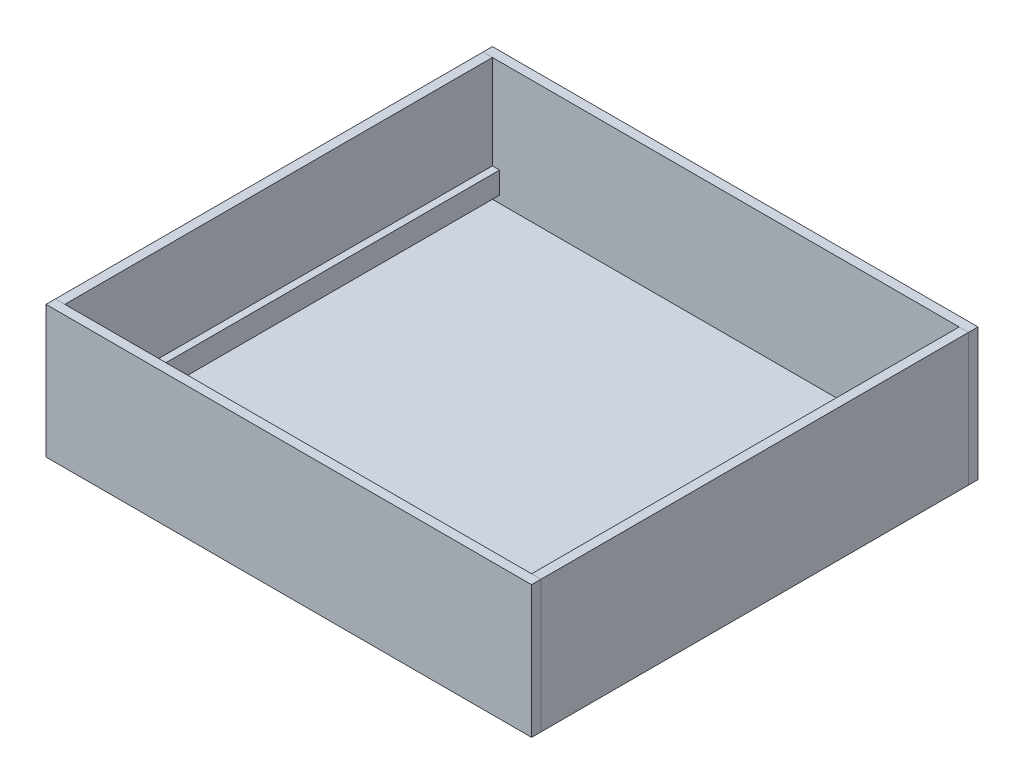
ISO-10303-21;
HEADER;
FILE_DESCRIPTION(('STEP AP214'),'2;1');
FILE_NAME('part.step','',(''),(''),'','','');
FILE_SCHEMA(('AUTOMOTIVE_DESIGN { 1 0 10303 214 1 1 1 1 }'));
ENDSEC;
DATA;
#1=APPLICATION_CONTEXT('core data for automotive mechanical design processes');
#2=APPLICATION_PROTOCOL_DEFINITION('international standard','automotive_design',2000,#1);
#3=PRODUCT_CONTEXT('',#1,'mechanical');
#4=PRODUCT('Part','Part','',(#3));
#5=PRODUCT_RELATED_PRODUCT_CATEGORY('part','',(#4));
#6=PRODUCT_DEFINITION_FORMATION('','',#4);
#7=PRODUCT_DEFINITION_CONTEXT('part definition',#1,'design');
#8=PRODUCT_DEFINITION('design','',#6,#7);
#9=PRODUCT_DEFINITION_SHAPE('','',#8);
#10=(LENGTH_UNIT() NAMED_UNIT(*) SI_UNIT(.MILLI.,.METRE.));
#11=(NAMED_UNIT(*) PLANE_ANGLE_UNIT() SI_UNIT($,.RADIAN.));
#12=(NAMED_UNIT(*) SI_UNIT($,.STERADIAN.) SOLID_ANGLE_UNIT());
#13=UNCERTAINTY_MEASURE_WITH_UNIT(LENGTH_MEASURE(1.E-05),#10,'distance_accuracy_value','');
#14=(GEOMETRIC_REPRESENTATION_CONTEXT(3) GLOBAL_UNCERTAINTY_ASSIGNED_CONTEXT((#13)) GLOBAL_UNIT_ASSIGNED_CONTEXT((#10,
#11,#12)) REPRESENTATION_CONTEXT('',''));
#15=CARTESIAN_POINT('',(0.,0.,0.));
#16=DIRECTION('',(0.,0.,1.));
#17=DIRECTION('',(1.,0.,0.));
#18=AXIS2_PLACEMENT_3D('',#15,#16,#17);
#19=CARTESIAN_POINT('',(-425.45,231.775,16.51));
#20=DIRECTION('',(1.,0.,0.));
#21=DIRECTION('',(0.,0.,-1.));
#22=AXIS2_PLACEMENT_3D('',#19,#20,#21);
#23=PLANE('',#22);
#24=DIRECTION('',(0.,-1.,0.));
#25=VECTOR('',#24,1.);
#26=CARTESIAN_POINT('',(-425.45,231.775,0.));
#27=LINE('',#26,#25);
#28=CARTESIAN_POINT('',(-425.45,231.775,0.));
#29=VERTEX_POINT('',#28);
#30=CARTESIAN_POINT('',(-425.45,0.,0.));
#31=VERTEX_POINT('',#30);
#32=EDGE_CURVE('E119',#29,#31,#27,.T.);
#33=ORIENTED_EDGE('',*,*,#32,.T.);
#34=DIRECTION('',(0.,0.,-1.));
#35=VECTOR('',#34,1.);
#36=CARTESIAN_POINT('',(-425.45,0.,16.51));
#37=LINE('',#36,#35);
#38=CARTESIAN_POINT('',(-425.45,0.,16.51));
#39=VERTEX_POINT('',#38);
#40=EDGE_CURVE('E12',#39,#31,#37,.T.);
#41=ORIENTED_EDGE('',*,*,#40,.F.);
#42=DIRECTION('',(0.,-1.,0.));
#43=VECTOR('',#42,1.);
#44=CARTESIAN_POINT('',(-425.45,231.775,16.51));
#45=LINE('',#44,#43);
#46=CARTESIAN_POINT('',(-425.45,231.775,16.51));
#47=VERTEX_POINT('',#46);
#48=EDGE_CURVE('E107',#47,#39,#45,.T.);
#49=ORIENTED_EDGE('',*,*,#48,.F.);
#50=DIRECTION('',(0.,0.,-1.));
#51=VECTOR('',#50,1.);
#52=CARTESIAN_POINT('',(-425.45,231.775,16.51));
#53=LINE('',#52,#51);
#54=EDGE_CURVE('E115',#47,#29,#53,.T.);
#55=ORIENTED_EDGE('',*,*,#54,.T.);
#56=EDGE_LOOP('',(#33,#41,#49,#55));
#57=FACE_BOUND('',#56,.T.);
#58=ADVANCED_FACE('F56',(#57),#23,.F.);
#59=CARTESIAN_POINT('',(-425.45,0.,16.51));
#60=DIRECTION('',(0.,1.,0.));
#61=DIRECTION('',(0.,0.,1.));
#62=AXIS2_PLACEMENT_3D('',#59,#60,#61);
#63=PLANE('',#62);
#64=DIRECTION('',(1.,0.,0.));
#65=VECTOR('',#64,1.);
#66=CARTESIAN_POINT('',(-425.45,0.,0.));
#67=LINE('',#66,#65);
#68=CARTESIAN_POINT('',(425.45,0.,0.));
#69=VERTEX_POINT('',#68);
#70=EDGE_CURVE('E111',#31,#69,#67,.T.);
#71=ORIENTED_EDGE('',*,*,#70,.T.);
#72=DIRECTION('',(0.,0.,-1.));
#73=VECTOR('',#72,1.);
#74=CARTESIAN_POINT('',(425.45,0.,16.51));
#75=LINE('',#74,#73);
#76=CARTESIAN_POINT('',(425.45,0.,16.51));
#77=VERTEX_POINT('',#76);
#78=EDGE_CURVE('E64',#77,#69,#75,.T.);
#79=ORIENTED_EDGE('',*,*,#78,.F.);
#80=DIRECTION('',(1.,0.,0.));
#81=VECTOR('',#80,1.);
#82=CARTESIAN_POINT('',(-425.45,0.,16.51));
#83=LINE('',#82,#81);
#84=EDGE_CURVE('E102',#39,#77,#83,.T.);
#85=ORIENTED_EDGE('',*,*,#84,.F.);
#86=ORIENTED_EDGE('',*,*,#40,.T.);
#87=EDGE_LOOP('',(#71,#79,#85,#86));
#88=FACE_BOUND('',#87,.T.);
#89=ADVANCED_FACE('F110',(#88),#63,.F.);
#90=CARTESIAN_POINT('',(425.45,231.775,16.51));
#91=DIRECTION('',(-1.,0.,0.));
#92=DIRECTION('',(0.,0.,1.));
#93=AXIS2_PLACEMENT_3D('',#90,#91,#92);
#94=PLANE('',#93);
#95=DIRECTION('',(0.,1.,0.));
#96=VECTOR('',#95,1.);
#97=CARTESIAN_POINT('',(425.45,231.775,0.));
#98=LINE('',#97,#96);
#99=CARTESIAN_POINT('',(425.45,231.775,0.));
#100=VERTEX_POINT('',#99);
#101=EDGE_CURVE('E89',#69,#100,#98,.T.);
#102=ORIENTED_EDGE('',*,*,#101,.T.);
#103=DIRECTION('',(0.,0.,-1.));
#104=VECTOR('',#103,1.);
#105=CARTESIAN_POINT('',(425.45,231.775,16.51));
#106=LINE('',#105,#104);
#107=CARTESIAN_POINT('',(425.45,231.775,16.51));
#108=VERTEX_POINT('',#107);
#109=EDGE_CURVE('E112',#108,#100,#106,.T.);
#110=ORIENTED_EDGE('',*,*,#109,.F.);
#111=DIRECTION('',(0.,1.,0.));
#112=VECTOR('',#111,1.);
#113=CARTESIAN_POINT('',(425.45,231.775,16.51));
#114=LINE('',#113,#112);
#115=EDGE_CURVE('E105',#77,#108,#114,.T.);
#116=ORIENTED_EDGE('',*,*,#115,.F.);
#117=ORIENTED_EDGE('',*,*,#78,.T.);
#118=EDGE_LOOP('',(#102,#110,#116,#117));
#119=FACE_BOUND('',#118,.T.);
#120=ADVANCED_FACE('F113',(#119),#94,.F.);
#121=CARTESIAN_POINT('',(-425.45,231.775,16.51));
#122=DIRECTION('',(0.,-1.,0.));
#123=DIRECTION('',(0.,0.,-1.));
#124=AXIS2_PLACEMENT_3D('',#121,#122,#123);
#125=PLANE('',#124);
#126=DIRECTION('',(-1.,0.,0.));
#127=VECTOR('',#126,1.);
#128=CARTESIAN_POINT('',(-425.45,231.775,0.));
#129=LINE('',#128,#127);
#130=EDGE_CURVE('E95',#100,#29,#129,.T.);
#131=ORIENTED_EDGE('',*,*,#130,.T.);
#132=ORIENTED_EDGE('',*,*,#54,.F.);
#133=DIRECTION('',(-1.,0.,0.));
#134=VECTOR('',#133,1.);
#135=CARTESIAN_POINT('',(-425.45,231.775,16.51));
#136=LINE('',#135,#134);
#137=EDGE_CURVE('E72',#108,#47,#136,.T.);
#138=ORIENTED_EDGE('',*,*,#137,.F.);
#139=ORIENTED_EDGE('',*,*,#109,.T.);
#140=EDGE_LOOP('',(#131,#132,#138,#139));
#141=FACE_BOUND('',#140,.T.);
#142=ADVANCED_FACE('F126',(#141),#125,.F.);
#143=CARTESIAN_POINT('',(0.,0.,16.51));
#144=DIRECTION('',(0.,0.,1.));
#145=DIRECTION('',(1.,0.,0.));
#146=AXIS2_PLACEMENT_3D('',#143,#144,#145);
#147=PLANE('',#146);
#148=ORIENTED_EDGE('',*,*,#48,.T.);
#149=ORIENTED_EDGE('',*,*,#84,.T.);
#150=ORIENTED_EDGE('',*,*,#115,.T.);
#151=ORIENTED_EDGE('',*,*,#137,.T.);
#152=EDGE_LOOP('',(#148,#149,#150,#151));
#153=FACE_BOUND('',#152,.T.);
#154=ADVANCED_FACE('F103',(#153),#147,.T.);
#155=CARTESIAN_POINT('',(0.,0.,0.));
#156=DIRECTION('',(0.,0.,1.));
#157=DIRECTION('',(1.,0.,0.));
#158=AXIS2_PLACEMENT_3D('',#155,#156,#157);
#159=PLANE('',#158);
#160=ORIENTED_EDGE('',*,*,#32,.F.);
#161=ORIENTED_EDGE('',*,*,#130,.F.);
#162=ORIENTED_EDGE('',*,*,#101,.F.);
#163=ORIENTED_EDGE('',*,*,#70,.F.);
#164=EDGE_LOOP('',(#160,#161,#162,#163));
#165=FACE_BOUND('',#164,.T.);
#166=ADVANCED_FACE('F129',(#165),#159,.F.);
#167=CLOSED_SHELL('',(#58,#89,#120,#142,#154,#166));
#168=MANIFOLD_SOLID_BREP('B2',#167);
#169=CARTESIAN_POINT('',(0.,0.,-749.3));
#170=DIRECTION('',(0.,0.,-1.));
#171=DIRECTION('',(1.,0.,0.));
#172=AXIS2_PLACEMENT_3D('',#169,#170,#171);
#173=PLANE('',#172);
#174=DIRECTION('',(0.,-1.,0.));
#175=VECTOR('',#174,1.);
#176=CARTESIAN_POINT('',(408.94,29.21,-749.3));
#177=LINE('',#176,#175);
#178=CARTESIAN_POINT('',(408.94,67.31,-749.3));
#179=VERTEX_POINT('',#178);
#180=CARTESIAN_POINT('',(408.94,29.21,-749.3));
#181=VERTEX_POINT('',#180);
#182=EDGE_CURVE('E198',#179,#181,#177,.T.);
#183=ORIENTED_EDGE('',*,*,#182,.T.);
#184=DIRECTION('',(-1.,0.,0.));
#185=VECTOR('',#184,1.);
#186=CARTESIAN_POINT('',(408.94,29.21,-749.3));
#187=LINE('',#186,#185);
#188=CARTESIAN_POINT('',(396.24,29.21,-749.3));
#189=VERTEX_POINT('',#188);
#190=EDGE_CURVE('E237',#181,#189,#187,.T.);
#191=ORIENTED_EDGE('',*,*,#190,.T.);
#192=DIRECTION('',(0.,1.,0.));
#193=VECTOR('',#192,1.);
#194=CARTESIAN_POINT('',(396.24,29.21,-749.3));
#195=LINE('',#194,#193);
#196=CARTESIAN_POINT('',(396.24,67.31,-749.3));
#197=VERTEX_POINT('',#196);
#198=EDGE_CURVE('E235',#189,#197,#195,.T.);
#199=ORIENTED_EDGE('',*,*,#198,.T.);
#200=DIRECTION('',(1.,0.,0.));
#201=VECTOR('',#200,1.);
#202=CARTESIAN_POINT('',(408.94,67.31,-749.3));
#203=LINE('',#202,#201);
#204=EDGE_CURVE('E255',#197,#179,#203,.T.);
#205=ORIENTED_EDGE('',*,*,#204,.T.);
#206=EDGE_LOOP('',(#183,#191,#199,#205));
#207=FACE_BOUND('',#206,.T.);
#208=ADVANCED_FACE('F190',(#207),#173,.T.);
#209=CARTESIAN_POINT('',(0.,0.,0.));
#210=DIRECTION('',(0.,0.,-1.));
#211=DIRECTION('',(1.,0.,0.));
#212=AXIS2_PLACEMENT_3D('',#209,#210,#211);
#213=PLANE('',#212);
#214=DIRECTION('',(0.,-1.,0.));
#215=VECTOR('',#214,1.);
#216=CARTESIAN_POINT('',(408.94,29.21,0.));
#217=LINE('',#216,#215);
#218=CARTESIAN_POINT('',(408.94,67.31,0.));
#219=VERTEX_POINT('',#218);
#220=CARTESIAN_POINT('',(408.94,29.21,0.));
#221=VERTEX_POINT('',#220);
#222=EDGE_CURVE('E243',#219,#221,#217,.T.);
#223=ORIENTED_EDGE('',*,*,#222,.F.);
#224=DIRECTION('',(1.,0.,0.));
#225=VECTOR('',#224,1.);
#226=CARTESIAN_POINT('',(408.94,67.31,0.));
#227=LINE('',#226,#225);
#228=CARTESIAN_POINT('',(396.24,67.31,0.));
#229=VERTEX_POINT('',#228);
#230=EDGE_CURVE('E246',#229,#219,#227,.T.);
#231=ORIENTED_EDGE('',*,*,#230,.F.);
#232=DIRECTION('',(0.,1.,0.));
#233=VECTOR('',#232,1.);
#234=CARTESIAN_POINT('',(396.24,29.21,0.));
#235=LINE('',#234,#233);
#236=CARTESIAN_POINT('',(396.24,29.21,0.));
#237=VERTEX_POINT('',#236);
#238=EDGE_CURVE('E232',#237,#229,#235,.T.);
#239=ORIENTED_EDGE('',*,*,#238,.F.);
#240=DIRECTION('',(-1.,0.,0.));
#241=VECTOR('',#240,1.);
#242=CARTESIAN_POINT('',(408.94,29.21,0.));
#243=LINE('',#242,#241);
#244=EDGE_CURVE('E238',#221,#237,#243,.T.);
#245=ORIENTED_EDGE('',*,*,#244,.F.);
#246=EDGE_LOOP('',(#223,#231,#239,#245));
#247=FACE_BOUND('',#246,.T.);
#248=ADVANCED_FACE('F245',(#247),#213,.F.);
#249=CARTESIAN_POINT('',(408.94,29.21,-789.460926284138));
#250=DIRECTION('',(0.,-1.,0.));
#251=DIRECTION('',(-1.,0.,0.));
#252=AXIS2_PLACEMENT_3D('',#249,#250,#251);
#253=PLANE('',#252);
#254=DIRECTION('',(0.,0.,1.));
#255=VECTOR('',#254,1.);
#256=CARTESIAN_POINT('',(408.94,29.21,-789.460926284138));
#257=LINE('',#256,#255);
#258=EDGE_CURVE('E54',#181,#221,#257,.T.);
#259=ORIENTED_EDGE('',*,*,#258,.T.);
#260=ORIENTED_EDGE('',*,*,#244,.T.);
#261=DIRECTION('',(0.,0.,1.));
#262=VECTOR('',#261,1.);
#263=CARTESIAN_POINT('',(396.24,29.21,-789.460926284138));
#264=LINE('',#263,#262);
#265=EDGE_CURVE('E227',#189,#237,#264,.T.);
#266=ORIENTED_EDGE('',*,*,#265,.F.);
#267=ORIENTED_EDGE('',*,*,#190,.F.);
#268=EDGE_LOOP('',(#259,#260,#266,#267));
#269=FACE_BOUND('',#268,.T.);
#270=ADVANCED_FACE('F239',(#269),#253,.T.);
#271=CARTESIAN_POINT('',(396.24,29.21,-789.460926284138));
#272=DIRECTION('',(-1.,0.,0.));
#273=DIRECTION('',(0.,0.,-1.));
#274=AXIS2_PLACEMENT_3D('',#271,#272,#273);
#275=PLANE('',#274);
#276=ORIENTED_EDGE('',*,*,#265,.T.);
#277=ORIENTED_EDGE('',*,*,#238,.T.);
#278=DIRECTION('',(0.,0.,1.));
#279=VECTOR('',#278,1.);
#280=CARTESIAN_POINT('',(396.24,67.31,-789.460926284138));
#281=LINE('',#280,#279);
#282=EDGE_CURVE('E222',#197,#229,#281,.T.);
#283=ORIENTED_EDGE('',*,*,#282,.F.);
#284=ORIENTED_EDGE('',*,*,#198,.F.);
#285=EDGE_LOOP('',(#276,#277,#283,#284));
#286=FACE_BOUND('',#285,.T.);
#287=ADVANCED_FACE('F230',(#286),#275,.T.);
#288=CARTESIAN_POINT('',(408.94,67.31,-789.460926284138));
#289=DIRECTION('',(0.,1.,0.));
#290=DIRECTION('',(0.,0.,1.));
#291=AXIS2_PLACEMENT_3D('',#288,#289,#290);
#292=PLANE('',#291);
#293=ORIENTED_EDGE('',*,*,#282,.T.);
#294=ORIENTED_EDGE('',*,*,#230,.T.);
#295=DIRECTION('',(0.,0.,1.));
#296=VECTOR('',#295,1.);
#297=CARTESIAN_POINT('',(408.94,67.31,-789.460926284138));
#298=LINE('',#297,#296);
#299=EDGE_CURVE('E254',#179,#219,#298,.T.);
#300=ORIENTED_EDGE('',*,*,#299,.F.);
#301=ORIENTED_EDGE('',*,*,#204,.F.);
#302=EDGE_LOOP('',(#293,#294,#300,#301));
#303=FACE_BOUND('',#302,.T.);
#304=ADVANCED_FACE('F263',(#303),#292,.T.);
#305=CARTESIAN_POINT('',(408.94,29.21,-789.460926284138));
#306=DIRECTION('',(1.,0.,0.));
#307=DIRECTION('',(0.,0.,1.));
#308=AXIS2_PLACEMENT_3D('',#305,#306,#307);
#309=PLANE('',#308);
#310=ORIENTED_EDGE('',*,*,#299,.T.);
#311=ORIENTED_EDGE('',*,*,#222,.T.);
#312=ORIENTED_EDGE('',*,*,#258,.F.);
#313=ORIENTED_EDGE('',*,*,#182,.F.);
#314=EDGE_LOOP('',(#310,#311,#312,#313));
#315=FACE_BOUND('',#314,.T.);
#316=ADVANCED_FACE('F262',(#315),#309,.T.);
#317=CLOSED_SHELL('',(#208,#248,#270,#287,#304,#316));
#318=MANIFOLD_SOLID_BREP('B6',#317);
#319=CARTESIAN_POINT('',(0.,0.,-749.3));
#320=DIRECTION('',(0.,0.,-1.));
#321=DIRECTION('',(-1.,0.,0.));
#322=AXIS2_PLACEMENT_3D('',#319,#320,#321);
#323=PLANE('',#322);
#324=DIRECTION('',(0.,-1.,0.));
#325=VECTOR('',#324,1.);
#326=CARTESIAN_POINT('',(-408.94,29.21,-749.3));
#327=LINE('',#326,#325);
#328=CARTESIAN_POINT('',(-408.94,67.31,-749.3));
#329=VERTEX_POINT('',#328);
#330=CARTESIAN_POINT('',(-408.94,29.21,-749.3));
#331=VERTEX_POINT('',#330);
#332=EDGE_CURVE('E332',#329,#331,#327,.T.);
#333=ORIENTED_EDGE('',*,*,#332,.F.);
#334=DIRECTION('',(-1.,0.,0.));
#335=VECTOR('',#334,1.);
#336=CARTESIAN_POINT('',(-408.94,67.31,-749.3));
#337=LINE('',#336,#335);
#338=CARTESIAN_POINT('',(-396.24,67.31,-749.3));
#339=VERTEX_POINT('',#338);
#340=EDGE_CURVE('E355',#339,#329,#337,.T.);
#341=ORIENTED_EDGE('',*,*,#340,.F.);
#342=DIRECTION('',(0.,1.,0.));
#343=VECTOR('',#342,1.);
#344=CARTESIAN_POINT('',(-396.24,29.21,-749.3));
#345=LINE('',#344,#343);
#346=CARTESIAN_POINT('',(-396.24,29.21,-749.3));
#347=VERTEX_POINT('',#346);
#348=EDGE_CURVE('E360',#347,#339,#345,.T.);
#349=ORIENTED_EDGE('',*,*,#348,.F.);
#350=DIRECTION('',(1.,0.,0.));
#351=VECTOR('',#350,1.);
#352=CARTESIAN_POINT('',(-408.94,29.21,-749.3));
#353=LINE('',#352,#351);
#354=EDGE_CURVE('E375',#331,#347,#353,.T.);
#355=ORIENTED_EDGE('',*,*,#354,.F.);
#356=EDGE_LOOP('',(#333,#341,#349,#355));
#357=FACE_BOUND('',#356,.T.);
#358=ADVANCED_FACE('F324',(#357),#323,.T.);
#359=CARTESIAN_POINT('',(0.,0.,0.));
#360=DIRECTION('',(0.,0.,-1.));
#361=DIRECTION('',(-1.,0.,0.));
#362=AXIS2_PLACEMENT_3D('',#359,#360,#361);
#363=PLANE('',#362);
#364=DIRECTION('',(0.,-1.,0.));
#365=VECTOR('',#364,1.);
#366=CARTESIAN_POINT('',(-408.94,29.21,0.));
#367=LINE('',#366,#365);
#368=CARTESIAN_POINT('',(-408.94,67.31,0.));
#369=VERTEX_POINT('',#368);
#370=CARTESIAN_POINT('',(-408.94,29.21,0.));
#371=VERTEX_POINT('',#370);
#372=EDGE_CURVE('E384',#369,#371,#367,.T.);
#373=ORIENTED_EDGE('',*,*,#372,.T.);
#374=DIRECTION('',(1.,0.,0.));
#375=VECTOR('',#374,1.);
#376=CARTESIAN_POINT('',(-408.94,29.21,0.));
#377=LINE('',#376,#375);
#378=CARTESIAN_POINT('',(-396.24,29.21,0.));
#379=VERTEX_POINT('',#378);
#380=EDGE_CURVE('E373',#371,#379,#377,.T.);
#381=ORIENTED_EDGE('',*,*,#380,.T.);
#382=DIRECTION('',(0.,1.,0.));
#383=VECTOR('',#382,1.);
#384=CARTESIAN_POINT('',(-396.24,29.21,0.));
#385=LINE('',#384,#383);
#386=CARTESIAN_POINT('',(-396.24,67.31,0.));
#387=VERTEX_POINT('',#386);
#388=EDGE_CURVE('E376',#379,#387,#385,.T.);
#389=ORIENTED_EDGE('',*,*,#388,.T.);
#390=DIRECTION('',(-1.,0.,0.));
#391=VECTOR('',#390,1.);
#392=CARTESIAN_POINT('',(-408.94,67.31,0.));
#393=LINE('',#392,#391);
#394=EDGE_CURVE('E381',#387,#369,#393,.T.);
#395=ORIENTED_EDGE('',*,*,#394,.T.);
#396=EDGE_LOOP('',(#373,#381,#389,#395));
#397=FACE_BOUND('',#396,.T.);
#398=ADVANCED_FACE('F383',(#397),#363,.F.);
#399=CARTESIAN_POINT('',(-408.94,29.21,-789.460926284138));
#400=DIRECTION('',(0.,-1.,0.));
#401=DIRECTION('',(1.,0.,0.));
#402=AXIS2_PLACEMENT_3D('',#399,#400,#401);
#403=PLANE('',#402);
#404=DIRECTION('',(0.,0.,1.));
#405=VECTOR('',#404,1.);
#406=CARTESIAN_POINT('',(-408.94,29.21,-789.460926284138));
#407=LINE('',#406,#405);
#408=EDGE_CURVE('E188',#331,#371,#407,.T.);
#409=ORIENTED_EDGE('',*,*,#408,.F.);
#410=ORIENTED_EDGE('',*,*,#354,.T.);
#411=DIRECTION('',(0.,0.,1.));
#412=VECTOR('',#411,1.);
#413=CARTESIAN_POINT('',(-396.24,29.21,-789.460926284138));
#414=LINE('',#413,#412);
#415=EDGE_CURVE('E370',#347,#379,#414,.T.);
#416=ORIENTED_EDGE('',*,*,#415,.T.);
#417=ORIENTED_EDGE('',*,*,#380,.F.);
#418=EDGE_LOOP('',(#409,#410,#416,#417));
#419=FACE_BOUND('',#418,.T.);
#420=ADVANCED_FACE('F371',(#419),#403,.T.);
#421=CARTESIAN_POINT('',(-396.24,29.21,-789.460926284138));
#422=DIRECTION('',(1.,0.,0.));
#423=DIRECTION('',(0.,0.,-1.));
#424=AXIS2_PLACEMENT_3D('',#421,#422,#423);
#425=PLANE('',#424);
#426=ORIENTED_EDGE('',*,*,#415,.F.);
#427=ORIENTED_EDGE('',*,*,#348,.T.);
#428=DIRECTION('',(0.,0.,1.));
#429=VECTOR('',#428,1.);
#430=CARTESIAN_POINT('',(-396.24,67.31,-789.460926284138));
#431=LINE('',#430,#429);
#432=EDGE_CURVE('E365',#339,#387,#431,.T.);
#433=ORIENTED_EDGE('',*,*,#432,.T.);
#434=ORIENTED_EDGE('',*,*,#388,.F.);
#435=EDGE_LOOP('',(#426,#427,#433,#434));
#436=FACE_BOUND('',#435,.T.);
#437=ADVANCED_FACE('F377',(#436),#425,.T.);
#438=CARTESIAN_POINT('',(-408.94,67.31,-789.460926284138));
#439=DIRECTION('',(0.,1.,0.));
#440=DIRECTION('',(0.,0.,1.));
#441=AXIS2_PLACEMENT_3D('',#438,#439,#440);
#442=PLANE('',#441);
#443=ORIENTED_EDGE('',*,*,#432,.F.);
#444=ORIENTED_EDGE('',*,*,#340,.T.);
#445=DIRECTION('',(0.,0.,1.));
#446=VECTOR('',#445,1.);
#447=CARTESIAN_POINT('',(-408.94,67.31,-789.460926284138));
#448=LINE('',#447,#446);
#449=EDGE_CURVE('E391',#329,#369,#448,.T.);
#450=ORIENTED_EDGE('',*,*,#449,.T.);
#451=ORIENTED_EDGE('',*,*,#394,.F.);
#452=EDGE_LOOP('',(#443,#444,#450,#451));
#453=FACE_BOUND('',#452,.T.);
#454=ADVANCED_FACE('F397',(#453),#442,.T.);
#455=CARTESIAN_POINT('',(-408.94,29.21,-789.460926284138));
#456=DIRECTION('',(-1.,0.,0.));
#457=DIRECTION('',(0.,0.,1.));
#458=AXIS2_PLACEMENT_3D('',#455,#456,#457);
#459=PLANE('',#458);
#460=ORIENTED_EDGE('',*,*,#449,.F.);
#461=ORIENTED_EDGE('',*,*,#332,.T.);
#462=ORIENTED_EDGE('',*,*,#408,.T.);
#463=ORIENTED_EDGE('',*,*,#372,.F.);
#464=EDGE_LOOP('',(#460,#461,#462,#463));
#465=FACE_BOUND('',#464,.T.);
#466=ADVANCED_FACE('F398',(#465),#459,.T.);
#467=CLOSED_SHELL('',(#358,#398,#420,#437,#454,#466));
#468=MANIFOLD_SOLID_BREP('B48',#467);
#469=CARTESIAN_POINT('',(425.45,231.775,-765.81));
#470=DIRECTION('',(-1.,0.,0.));
#471=DIRECTION('',(0.,-1.,0.));
#472=AXIS2_PLACEMENT_3D('',#469,#470,#471);
#473=PLANE('',#472);
#474=DIRECTION('',(0.,-1.,0.));
#475=VECTOR('',#474,1.);
#476=CARTESIAN_POINT('',(425.45,231.775,-749.3));
#477=LINE('',#476,#475);
#478=CARTESIAN_POINT('',(425.45,231.775,-749.3));
#479=VERTEX_POINT('',#478);
#480=CARTESIAN_POINT('',(425.45,0.,-749.3));
#481=VERTEX_POINT('',#480);
#482=EDGE_CURVE('E521',#479,#481,#477,.T.);
#483=ORIENTED_EDGE('',*,*,#482,.T.);
#484=DIRECTION('',(0.,0.,1.));
#485=VECTOR('',#484,1.);
#486=CARTESIAN_POINT('',(425.45,0.,-765.81));
#487=LINE('',#486,#485);
#488=CARTESIAN_POINT('',(425.45,0.,-765.81));
#489=VERTEX_POINT('',#488);
#490=EDGE_CURVE('E322',#489,#481,#487,.T.);
#491=ORIENTED_EDGE('',*,*,#490,.F.);
#492=DIRECTION('',(0.,-1.,0.));
#493=VECTOR('',#492,1.);
#494=CARTESIAN_POINT('',(425.45,231.775,-765.81));
#495=LINE('',#494,#493);
#496=CARTESIAN_POINT('',(425.45,231.775,-765.81));
#497=VERTEX_POINT('',#496);
#498=EDGE_CURVE('E509',#497,#489,#495,.T.);
#499=ORIENTED_EDGE('',*,*,#498,.F.);
#500=DIRECTION('',(0.,0.,1.));
#501=VECTOR('',#500,1.);
#502=CARTESIAN_POINT('',(425.45,231.775,-765.81));
#503=LINE('',#502,#501);
#504=EDGE_CURVE('E517',#497,#479,#503,.T.);
#505=ORIENTED_EDGE('',*,*,#504,.T.);
#506=EDGE_LOOP('',(#483,#491,#499,#505));
#507=FACE_BOUND('',#506,.T.);
#508=ADVANCED_FACE('F458',(#507),#473,.F.);
#509=CARTESIAN_POINT('',(425.45,0.,-765.81));
#510=DIRECTION('',(0.,1.,0.));
#511=DIRECTION('',(0.,0.,1.));
#512=AXIS2_PLACEMENT_3D('',#509,#510,#511);
#513=PLANE('',#512);
#514=DIRECTION('',(-1.,0.,0.));
#515=VECTOR('',#514,1.);
#516=CARTESIAN_POINT('',(425.45,0.,-749.3));
#517=LINE('',#516,#515);
#518=CARTESIAN_POINT('',(-425.45,0.,-749.3));
#519=VERTEX_POINT('',#518);
#520=EDGE_CURVE('E513',#481,#519,#517,.T.);
#521=ORIENTED_EDGE('',*,*,#520,.T.);
#522=DIRECTION('',(0.,0.,1.));
#523=VECTOR('',#522,1.);
#524=CARTESIAN_POINT('',(-425.45,0.,-765.81));
#525=LINE('',#524,#523);
#526=CARTESIAN_POINT('',(-425.45,0.,-765.81));
#527=VERTEX_POINT('',#526);
#528=EDGE_CURVE('E466',#527,#519,#525,.T.);
#529=ORIENTED_EDGE('',*,*,#528,.F.);
#530=DIRECTION('',(-1.,0.,0.));
#531=VECTOR('',#530,1.);
#532=CARTESIAN_POINT('',(425.45,0.,-765.81));
#533=LINE('',#532,#531);
#534=EDGE_CURVE('E504',#489,#527,#533,.T.);
#535=ORIENTED_EDGE('',*,*,#534,.F.);
#536=ORIENTED_EDGE('',*,*,#490,.T.);
#537=EDGE_LOOP('',(#521,#529,#535,#536));
#538=FACE_BOUND('',#537,.T.);
#539=ADVANCED_FACE('F512',(#538),#513,.F.);
#540=CARTESIAN_POINT('',(-425.45,231.775,-765.81));
#541=DIRECTION('',(1.,0.,0.));
#542=DIRECTION('',(0.,0.,-1.));
#543=AXIS2_PLACEMENT_3D('',#540,#541,#542);
#544=PLANE('',#543);
#545=DIRECTION('',(0.,1.,0.));
#546=VECTOR('',#545,1.);
#547=CARTESIAN_POINT('',(-425.45,231.775,-749.3));
#548=LINE('',#547,#546);
#549=CARTESIAN_POINT('',(-425.45,231.775,-749.3));
#550=VERTEX_POINT('',#549);
#551=EDGE_CURVE('E491',#519,#550,#548,.T.);
#552=ORIENTED_EDGE('',*,*,#551,.T.);
#553=DIRECTION('',(0.,0.,1.));
#554=VECTOR('',#553,1.);
#555=CARTESIAN_POINT('',(-425.45,231.775,-765.81));
#556=LINE('',#555,#554);
#557=CARTESIAN_POINT('',(-425.45,231.775,-765.81));
#558=VERTEX_POINT('',#557);
#559=EDGE_CURVE('E514',#558,#550,#556,.T.);
#560=ORIENTED_EDGE('',*,*,#559,.F.);
#561=DIRECTION('',(0.,1.,0.));
#562=VECTOR('',#561,1.);
#563=CARTESIAN_POINT('',(-425.45,231.775,-765.81));
#564=LINE('',#563,#562);
#565=EDGE_CURVE('E507',#527,#558,#564,.T.);
#566=ORIENTED_EDGE('',*,*,#565,.F.);
#567=ORIENTED_EDGE('',*,*,#528,.T.);
#568=EDGE_LOOP('',(#552,#560,#566,#567));
#569=FACE_BOUND('',#568,.T.);
#570=ADVANCED_FACE('F515',(#569),#544,.F.);
#571=CARTESIAN_POINT('',(425.45,231.775,-765.81));
#572=DIRECTION('',(0.,-1.,0.));
#573=DIRECTION('',(0.,0.,-1.));
#574=AXIS2_PLACEMENT_3D('',#571,#572,#573);
#575=PLANE('',#574);
#576=DIRECTION('',(1.,0.,0.));
#577=VECTOR('',#576,1.);
#578=CARTESIAN_POINT('',(425.45,231.775,-749.3));
#579=LINE('',#578,#577);
#580=EDGE_CURVE('E497',#550,#479,#579,.T.);
#581=ORIENTED_EDGE('',*,*,#580,.T.);
#582=ORIENTED_EDGE('',*,*,#504,.F.);
#583=DIRECTION('',(1.,0.,0.));
#584=VECTOR('',#583,1.);
#585=CARTESIAN_POINT('',(425.45,231.775,-765.81));
#586=LINE('',#585,#584);
#587=EDGE_CURVE('E474',#558,#497,#586,.T.);
#588=ORIENTED_EDGE('',*,*,#587,.F.);
#589=ORIENTED_EDGE('',*,*,#559,.T.);
#590=EDGE_LOOP('',(#581,#582,#588,#589));
#591=FACE_BOUND('',#590,.T.);
#592=ADVANCED_FACE('F528',(#591),#575,.F.);
#593=CARTESIAN_POINT('',(0.,0.,-765.81));
#594=DIRECTION('',(0.,0.,-1.));
#595=DIRECTION('',(-1.,0.,0.));
#596=AXIS2_PLACEMENT_3D('',#593,#594,#595);
#597=PLANE('',#596);
#598=ORIENTED_EDGE('',*,*,#498,.T.);
#599=ORIENTED_EDGE('',*,*,#534,.T.);
#600=ORIENTED_EDGE('',*,*,#565,.T.);
#601=ORIENTED_EDGE('',*,*,#587,.T.);
#602=EDGE_LOOP('',(#598,#599,#600,#601));
#603=FACE_BOUND('',#602,.T.);
#604=ADVANCED_FACE('F505',(#603),#597,.T.);
#605=CARTESIAN_POINT('',(0.,0.,-749.3));
#606=DIRECTION('',(0.,0.,-1.));
#607=DIRECTION('',(-1.,0.,0.));
#608=AXIS2_PLACEMENT_3D('',#605,#606,#607);
#609=PLANE('',#608);
#610=ORIENTED_EDGE('',*,*,#482,.F.);
#611=ORIENTED_EDGE('',*,*,#580,.F.);
#612=ORIENTED_EDGE('',*,*,#551,.F.);
#613=ORIENTED_EDGE('',*,*,#520,.F.);
#614=EDGE_LOOP('',(#610,#611,#612,#613));
#615=FACE_BOUND('',#614,.T.);
#616=ADVANCED_FACE('F531',(#615),#609,.F.);
#617=CLOSED_SHELL('',(#508,#539,#570,#592,#604,#616));
#618=MANIFOLD_SOLID_BREP('B182',#617);
#619=CARTESIAN_POINT('',(0.,0.,-1567.34662122644));
#620=DIRECTION('',(0.,-1.,0.));
#621=DIRECTION('',(0.,0.,-1.));
#622=AXIS2_PLACEMENT_3D('',#619,#620,#621);
#623=PLANE('',#622);
#624=DIRECTION('',(-1.,0.,0.));
#625=VECTOR('',#624,1.);
#626=CARTESIAN_POINT('',(0.,0.,-749.3));
#627=LINE('',#626,#625);
#628=CARTESIAN_POINT('',(408.94,0.,-749.3));
#629=VERTEX_POINT('',#628);
#630=CARTESIAN_POINT('',(-408.94,0.,-749.3));
#631=VERTEX_POINT('',#630);
#632=EDGE_CURVE('E600',#629,#631,#627,.T.);
#633=ORIENTED_EDGE('',*,*,#632,.F.);
#634=DIRECTION('',(0.,0.,1.));
#635=VECTOR('',#634,1.);
#636=CARTESIAN_POINT('',(408.94,0.,-1567.34662122644));
#637=LINE('',#636,#635);
#638=CARTESIAN_POINT('',(408.94,0.,0.));
#639=VERTEX_POINT('',#638);
#640=EDGE_CURVE('E628',#629,#639,#637,.T.);
#641=ORIENTED_EDGE('',*,*,#640,.T.);
#642=DIRECTION('',(1.,0.,0.));
#643=VECTOR('',#642,1.);
#644=CARTESIAN_POINT('',(0.,0.,0.));
#645=LINE('',#644,#643);
#646=CARTESIAN_POINT('',(-408.94,0.,0.));
#647=VERTEX_POINT('',#646);
#648=EDGE_CURVE('E632',#647,#639,#645,.T.);
#649=ORIENTED_EDGE('',*,*,#648,.F.);
#650=DIRECTION('',(0.,0.,1.));
#651=VECTOR('',#650,1.);
#652=CARTESIAN_POINT('',(-408.94,0.,-1567.34662122644));
#653=LINE('',#652,#651);
#654=EDGE_CURVE('E655',#631,#647,#653,.T.);
#655=ORIENTED_EDGE('',*,*,#654,.F.);
#656=EDGE_LOOP('',(#633,#641,#649,#655));
#657=FACE_BOUND('',#656,.T.);
#658=ADVANCED_FACE('F592',(#657),#623,.T.);
#659=CARTESIAN_POINT('',(-408.94,0.,-1567.34662122644));
#660=DIRECTION('',(-1.,0.,0.));
#661=DIRECTION('',(0.,0.,1.));
#662=AXIS2_PLACEMENT_3D('',#659,#660,#661);
#663=PLANE('',#662);
#664=DIRECTION('',(0.,1.,0.));
#665=VECTOR('',#664,1.);
#666=CARTESIAN_POINT('',(-408.94,0.,-749.3));
#667=LINE('',#666,#665);
#668=CARTESIAN_POINT('',(-408.94,16.51,-749.3));
#669=VERTEX_POINT('',#668);
#670=EDGE_CURVE('E606',#631,#669,#667,.T.);
#671=ORIENTED_EDGE('',*,*,#670,.F.);
#672=ORIENTED_EDGE('',*,*,#654,.T.);
#673=DIRECTION('',(0.,-1.,0.));
#674=VECTOR('',#673,1.);
#675=CARTESIAN_POINT('',(-408.94,0.,0.));
#676=LINE('',#675,#674);
#677=CARTESIAN_POINT('',(-408.94,16.51,0.));
#678=VERTEX_POINT('',#677);
#679=EDGE_CURVE('E637',#678,#647,#676,.T.);
#680=ORIENTED_EDGE('',*,*,#679,.F.);
#681=DIRECTION('',(0.,0.,1.));
#682=VECTOR('',#681,1.);
#683=CARTESIAN_POINT('',(-408.94,16.51,-1567.34662122644));
#684=LINE('',#683,#682);
#685=EDGE_CURVE('E658',#669,#678,#684,.T.);
#686=ORIENTED_EDGE('',*,*,#685,.F.);
#687=EDGE_LOOP('',(#671,#672,#680,#686));
#688=FACE_BOUND('',#687,.T.);
#689=ADVANCED_FACE('F664',(#688),#663,.T.);
#690=CARTESIAN_POINT('',(0.,16.51,-1567.34662122644));
#691=DIRECTION('',(0.,-1.,0.));
#692=DIRECTION('',(0.,0.,-1.));
#693=AXIS2_PLACEMENT_3D('',#690,#691,#692);
#694=PLANE('',#693);
#695=DIRECTION('',(0.,0.,1.));
#696=VECTOR('',#695,1.);
#697=CARTESIAN_POINT('',(408.94,16.51,-1567.34662122644));
#698=LINE('',#697,#696);
#699=CARTESIAN_POINT('',(408.94,16.51,-749.3));
#700=VERTEX_POINT('',#699);
#701=CARTESIAN_POINT('',(408.94,16.51,0.));
#702=VERTEX_POINT('',#701);
#703=EDGE_CURVE('E636',#700,#702,#698,.T.);
#704=ORIENTED_EDGE('',*,*,#703,.F.);
#705=DIRECTION('',(-1.,0.,0.));
#706=VECTOR('',#705,1.);
#707=CARTESIAN_POINT('',(0.,16.51,-749.3));
#708=LINE('',#707,#706);
#709=EDGE_CURVE('E657',#700,#669,#708,.T.);
#710=ORIENTED_EDGE('',*,*,#709,.T.);
#711=ORIENTED_EDGE('',*,*,#685,.T.);
#712=DIRECTION('',(1.,0.,0.));
#713=VECTOR('',#712,1.);
#714=CARTESIAN_POINT('',(0.,16.51,0.));
#715=LINE('',#714,#713);
#716=EDGE_CURVE('E645',#678,#702,#715,.T.);
#717=ORIENTED_EDGE('',*,*,#716,.T.);
#718=EDGE_LOOP('',(#704,#710,#711,#717));
#719=FACE_BOUND('',#718,.T.);
#720=ADVANCED_FACE('F662',(#719),#694,.F.);
#721=CARTESIAN_POINT('',(408.94,1.95885925440713E-13,-1567.34662122644));
#722=DIRECTION('',(1.,0.,0.));
#723=DIRECTION('',(0.,1.,0.));
#724=AXIS2_PLACEMENT_3D('',#721,#722,#723);
#725=PLANE('',#724);
#726=DIRECTION('',(0.,-1.,0.));
#727=VECTOR('',#726,1.);
#728=CARTESIAN_POINT('',(408.94,1.95885925440713E-13,-749.3));
#729=LINE('',#728,#727);
#730=EDGE_CURVE('E456',#700,#629,#729,.T.);
#731=ORIENTED_EDGE('',*,*,#730,.F.);
#732=ORIENTED_EDGE('',*,*,#703,.T.);
#733=DIRECTION('',(0.,1.,0.));
#734=VECTOR('',#733,1.);
#735=CARTESIAN_POINT('',(408.94,1.95885925440713E-13,0.));
#736=LINE('',#735,#734);
#737=EDGE_CURVE('E639',#639,#702,#736,.T.);
#738=ORIENTED_EDGE('',*,*,#737,.F.);
#739=ORIENTED_EDGE('',*,*,#640,.F.);
#740=EDGE_LOOP('',(#731,#732,#738,#739));
#741=FACE_BOUND('',#740,.T.);
#742=ADVANCED_FACE('F640',(#741),#725,.T.);
#743=CARTESIAN_POINT('',(0.,0.,0.));
#744=DIRECTION('',(0.,0.,1.));
#745=DIRECTION('',(1.,0.,0.));
#746=AXIS2_PLACEMENT_3D('',#743,#744,#745);
#747=PLANE('',#746);
#748=ORIENTED_EDGE('',*,*,#648,.T.);
#749=ORIENTED_EDGE('',*,*,#737,.T.);
#750=ORIENTED_EDGE('',*,*,#716,.F.);
#751=ORIENTED_EDGE('',*,*,#679,.T.);
#752=EDGE_LOOP('',(#748,#749,#750,#751));
#753=FACE_BOUND('',#752,.T.);
#754=ADVANCED_FACE('F647',(#753),#747,.T.);
#755=CARTESIAN_POINT('',(0.,0.,-749.3));
#756=DIRECTION('',(0.,0.,1.));
#757=DIRECTION('',(1.,0.,0.));
#758=AXIS2_PLACEMENT_3D('',#755,#756,#757);
#759=PLANE('',#758);
#760=ORIENTED_EDGE('',*,*,#632,.T.);
#761=ORIENTED_EDGE('',*,*,#670,.T.);
#762=ORIENTED_EDGE('',*,*,#709,.F.);
#763=ORIENTED_EDGE('',*,*,#730,.T.);
#764=EDGE_LOOP('',(#760,#761,#762,#763));
#765=FACE_BOUND('',#764,.T.);
#766=ADVANCED_FACE('F666',(#765),#759,.F.);
#767=CLOSED_SHELL('',(#658,#689,#720,#742,#754,#766));
#768=MANIFOLD_SOLID_BREP('B316',#767);
#769=CARTESIAN_POINT('',(425.45,0.,-749.3));
#770=DIRECTION('',(-1.,0.,0.));
#771=DIRECTION('',(0.,0.,1.));
#772=AXIS2_PLACEMENT_3D('',#769,#770,#771);
#773=PLANE('',#772);
#774=DIRECTION('',(0.,-1.,0.));
#775=VECTOR('',#774,1.);
#776=CARTESIAN_POINT('',(425.45,0.,0.));
#777=LINE('',#776,#775);
#778=CARTESIAN_POINT('',(425.45,231.775,0.));
#779=VERTEX_POINT('',#778);
#780=CARTESIAN_POINT('',(425.45,0.,0.));
#781=VERTEX_POINT('',#780);
#782=EDGE_CURVE('E789',#779,#781,#777,.T.);
#783=ORIENTED_EDGE('',*,*,#782,.T.);
#784=DIRECTION('',(0.,0.,1.));
#785=VECTOR('',#784,1.);
#786=CARTESIAN_POINT('',(425.45,0.,-749.3));
#787=LINE('',#786,#785);
#788=CARTESIAN_POINT('',(425.45,0.,-749.3));
#789=VERTEX_POINT('',#788);
#790=EDGE_CURVE('E590',#789,#781,#787,.T.);
#791=ORIENTED_EDGE('',*,*,#790,.F.);
#792=DIRECTION('',(0.,-1.,0.));
#793=VECTOR('',#792,1.);
#794=CARTESIAN_POINT('',(425.45,0.,-749.3));
#795=LINE('',#794,#793);
#796=CARTESIAN_POINT('',(425.45,231.775,-749.3));
#797=VERTEX_POINT('',#796);
#798=EDGE_CURVE('E743',#797,#789,#795,.T.);
#799=ORIENTED_EDGE('',*,*,#798,.F.);
#800=DIRECTION('',(0.,0.,1.));
#801=VECTOR('',#800,1.);
#802=CARTESIAN_POINT('',(425.45,231.775,-749.3));
#803=LINE('',#802,#801);
#804=EDGE_CURVE('E728',#797,#779,#803,.T.);
#805=ORIENTED_EDGE('',*,*,#804,.T.);
#806=EDGE_LOOP('',(#783,#791,#799,#805));
#807=FACE_BOUND('',#806,.T.);
#808=ADVANCED_FACE('F725',(#807),#773,.F.);
#809=CARTESIAN_POINT('',(0.,0.,-749.3));
#810=DIRECTION('',(0.,-1.,0.));
#811=DIRECTION('',(0.,0.,-1.));
#812=AXIS2_PLACEMENT_3D('',#809,#810,#811);
#813=PLANE('',#812);
#814=DIRECTION('',(1.,0.,0.));
#815=VECTOR('',#814,1.);
#816=CARTESIAN_POINT('',(0.,0.,0.));
#817=LINE('',#816,#815);
#818=CARTESIAN_POINT('',(408.94,0.,0.));
#819=VERTEX_POINT('',#818);
#820=EDGE_CURVE('E784',#819,#781,#817,.T.);
#821=ORIENTED_EDGE('',*,*,#820,.F.);
#822=DIRECTION('',(0.,0.,1.));
#823=VECTOR('',#822,1.);
#824=CARTESIAN_POINT('',(408.94,0.,-749.3));
#825=LINE('',#824,#823);
#826=CARTESIAN_POINT('',(408.94,0.,-749.3));
#827=VERTEX_POINT('',#826);
#828=EDGE_CURVE('E734',#827,#819,#825,.T.);
#829=ORIENTED_EDGE('',*,*,#828,.F.);
#830=DIRECTION('',(1.,0.,0.));
#831=VECTOR('',#830,1.);
#832=CARTESIAN_POINT('',(0.,0.,-749.3));
#833=LINE('',#832,#831);
#834=EDGE_CURVE('E773',#827,#789,#833,.T.);
#835=ORIENTED_EDGE('',*,*,#834,.T.);
#836=ORIENTED_EDGE('',*,*,#790,.T.);
#837=EDGE_LOOP('',(#821,#829,#835,#836));
#838=FACE_BOUND('',#837,.T.);
#839=ADVANCED_FACE('F800',(#838),#813,.T.);
#840=CARTESIAN_POINT('',(408.94,1.95885925440713E-13,-749.3));
#841=DIRECTION('',(1.,0.,0.));
#842=DIRECTION('',(0.,1.,0.));
#843=AXIS2_PLACEMENT_3D('',#840,#841,#842);
#844=PLANE('',#843);
#845=DIRECTION('',(0.,1.,0.));
#846=VECTOR('',#845,1.);
#847=CARTESIAN_POINT('',(408.94,1.95885925440713E-13,0.));
#848=LINE('',#847,#846);
#849=CARTESIAN_POINT('',(408.94,231.775,0.));
#850=VERTEX_POINT('',#849);
#851=EDGE_CURVE('E778',#819,#850,#848,.T.);
#852=ORIENTED_EDGE('',*,*,#851,.T.);
#853=DIRECTION('',(0.,0.,1.));
#854=VECTOR('',#853,1.);
#855=CARTESIAN_POINT('',(408.94,231.775,-749.3));
#856=LINE('',#855,#854);
#857=CARTESIAN_POINT('',(408.94,231.775,-749.3));
#858=VERTEX_POINT('',#857);
#859=EDGE_CURVE('E776',#858,#850,#856,.T.);
#860=ORIENTED_EDGE('',*,*,#859,.F.);
#861=DIRECTION('',(0.,1.,0.));
#862=VECTOR('',#861,1.);
#863=CARTESIAN_POINT('',(408.94,1.95885925440713E-13,-749.3));
#864=LINE('',#863,#862);
#865=EDGE_CURVE('E770',#827,#858,#864,.T.);
#866=ORIENTED_EDGE('',*,*,#865,.F.);
#867=ORIENTED_EDGE('',*,*,#828,.T.);
#868=EDGE_LOOP('',(#852,#860,#866,#867));
#869=FACE_BOUND('',#868,.T.);
#870=ADVANCED_FACE('F777',(#869),#844,.F.);
#871=CARTESIAN_POINT('',(0.,231.775,-749.3));
#872=DIRECTION('',(0.,-1.,0.));
#873=DIRECTION('',(0.,0.,-1.));
#874=AXIS2_PLACEMENT_3D('',#871,#872,#873);
#875=PLANE('',#874);
#876=DIRECTION('',(1.,0.,0.));
#877=VECTOR('',#876,1.);
#878=CARTESIAN_POINT('',(0.,231.775,0.));
#879=LINE('',#878,#877);
#880=EDGE_CURVE('E791',#850,#779,#879,.T.);
#881=ORIENTED_EDGE('',*,*,#880,.T.);
#882=ORIENTED_EDGE('',*,*,#804,.F.);
#883=DIRECTION('',(1.,0.,0.));
#884=VECTOR('',#883,1.);
#885=CARTESIAN_POINT('',(0.,231.775,-749.3));
#886=LINE('',#885,#884);
#887=EDGE_CURVE('E768',#858,#797,#886,.T.);
#888=ORIENTED_EDGE('',*,*,#887,.F.);
#889=ORIENTED_EDGE('',*,*,#859,.T.);
#890=EDGE_LOOP('',(#881,#882,#888,#889));
#891=FACE_BOUND('',#890,.T.);
#892=ADVANCED_FACE('F781',(#891),#875,.F.);
#893=CARTESIAN_POINT('',(0.,0.,-749.3));
#894=DIRECTION('',(0.,0.,1.));
#895=DIRECTION('',(1.,0.,0.));
#896=AXIS2_PLACEMENT_3D('',#893,#894,#895);
#897=PLANE('',#896);
#898=ORIENTED_EDGE('',*,*,#798,.T.);
#899=ORIENTED_EDGE('',*,*,#834,.F.);
#900=ORIENTED_EDGE('',*,*,#865,.T.);
#901=ORIENTED_EDGE('',*,*,#887,.T.);
#902=EDGE_LOOP('',(#898,#899,#900,#901));
#903=FACE_BOUND('',#902,.T.);
#904=ADVANCED_FACE('F772',(#903),#897,.F.);
#905=CARTESIAN_POINT('',(0.,0.,0.));
#906=DIRECTION('',(0.,0.,1.));
#907=DIRECTION('',(1.,0.,0.));
#908=AXIS2_PLACEMENT_3D('',#905,#906,#907);
#909=PLANE('',#908);
#910=CARTESIAN_POINT('',(415.925,200.025,0.));
#911=DIRECTION('',(0.,0.,1.));
#912=DIRECTION('',(-1.,0.,0.));
#913=AXIS2_PLACEMENT_3D('',#910,#911,#912);
#914=CIRCLE('',#913,3.77031250000004);
#915=CARTESIAN_POINT('',(412.1546875,200.025,0.));
#916=VERTEX_POINT('',#915);
#917=EDGE_CURVE('E831',#916,#916,#914,.T.);
#918=ORIENTED_EDGE('',*,*,#917,.F.);
#919=EDGE_LOOP('',(#918));
#920=FACE_BOUND('',#919,.T.);
#921=ORIENTED_EDGE('',*,*,#782,.F.);
#922=ORIENTED_EDGE('',*,*,#880,.F.);
#923=ORIENTED_EDGE('',*,*,#851,.F.);
#924=ORIENTED_EDGE('',*,*,#820,.T.);
#925=EDGE_LOOP('',(#921,#922,#923,#924));
#926=FACE_BOUND('',#925,.T.);
#927=ADVANCED_FACE('F799',(#920,#926),#909,.T.);
#928=CARTESIAN_POINT('',(415.925,200.025,-12.7));
#929=DIRECTION('',(0.,0.,1.));
#930=DIRECTION('',(1.,0.,0.));
#931=AXIS2_PLACEMENT_3D('',#928,#929,#930);
#932=CYLINDRICAL_SURFACE('',#931,3.77031250000004);
#933=CARTESIAN_POINT('',(415.925,200.025,-12.7));
#934=DIRECTION('',(0.,0.,1.));
#935=DIRECTION('',(-1.,0.,0.));
#936=AXIS2_PLACEMENT_3D('',#933,#934,#935);
#937=CIRCLE('',#936,3.77031250000004);
#938=CARTESIAN_POINT('',(412.1546875,200.025,-12.7));
#939=VERTEX_POINT('',#938);
#940=EDGE_CURVE('E792',#939,#939,#937,.T.);
#941=ORIENTED_EDGE('',*,*,#940,.F.);
#942=EDGE_LOOP('',(#941));
#943=FACE_BOUND('',#942,.T.);
#944=ORIENTED_EDGE('',*,*,#917,.T.);
#945=EDGE_LOOP('',(#944));
#946=FACE_BOUND('',#945,.T.);
#947=ADVANCED_FACE('F818',(#943,#946),#932,.F.);
#948=CARTESIAN_POINT('',(415.925,200.025,-12.7));
#949=DIRECTION('',(0.,0.,-1.));
#950=DIRECTION('',(-1.,0.,0.));
#951=AXIS2_PLACEMENT_3D('',#948,#949,#950);
#952=PLANE('',#951);
#953=ORIENTED_EDGE('',*,*,#940,.T.);
#954=EDGE_LOOP('',(#953));
#955=FACE_BOUND('',#954,.T.);
#956=ADVANCED_FACE('F823',(#955),#952,.F.);
#957=CLOSED_SHELL('',(#808,#839,#870,#892,#904,#927,#947,#956));
#958=MANIFOLD_SOLID_BREP('B450',#957);
#959=CARTESIAN_POINT('',(-408.94,0.,-749.3));
#960=DIRECTION('',(-1.,0.,0.));
#961=DIRECTION('',(0.,0.,1.));
#962=AXIS2_PLACEMENT_3D('',#959,#960,#961);
#963=PLANE('',#962);
#964=DIRECTION('',(0.,-1.,0.));
#965=VECTOR('',#964,1.);
#966=CARTESIAN_POINT('',(-408.94,0.,0.));
#967=LINE('',#966,#965);
#968=CARTESIAN_POINT('',(-408.94,231.775,0.));
#969=VERTEX_POINT('',#968);
#970=CARTESIAN_POINT('',(-408.94,0.,0.));
#971=VERTEX_POINT('',#970);
#972=EDGE_CURVE('E943',#969,#971,#967,.T.);
#973=ORIENTED_EDGE('',*,*,#972,.T.);
#974=DIRECTION('',(0.,0.,1.));
#975=VECTOR('',#974,1.);
#976=CARTESIAN_POINT('',(-408.94,0.,-749.3));
#977=LINE('',#976,#975);
#978=CARTESIAN_POINT('',(-408.94,0.,-749.3));
#979=VERTEX_POINT('',#978);
#980=EDGE_CURVE('E723',#979,#971,#977,.T.);
#981=ORIENTED_EDGE('',*,*,#980,.F.);
#982=DIRECTION('',(0.,-1.,0.));
#983=VECTOR('',#982,1.);
#984=CARTESIAN_POINT('',(-408.94,0.,-749.3));
#985=LINE('',#984,#983);
#986=CARTESIAN_POINT('',(-408.94,231.775,-749.3));
#987=VERTEX_POINT('',#986);
#988=EDGE_CURVE('E897',#987,#979,#985,.T.);
#989=ORIENTED_EDGE('',*,*,#988,.F.);
#990=DIRECTION('',(0.,0.,1.));
#991=VECTOR('',#990,1.);
#992=CARTESIAN_POINT('',(-408.94,231.775,-749.3));
#993=LINE('',#992,#991);
#994=EDGE_CURVE('E882',#987,#969,#993,.T.);
#995=ORIENTED_EDGE('',*,*,#994,.T.);
#996=EDGE_LOOP('',(#973,#981,#989,#995));
#997=FACE_BOUND('',#996,.T.);
#998=ADVANCED_FACE('F879',(#997),#963,.F.);
#999=CARTESIAN_POINT('',(0.,0.,-749.3));
#1000=DIRECTION('',(0.,-1.,0.));
#1001=DIRECTION('',(0.,0.,-1.));
#1002=AXIS2_PLACEMENT_3D('',#999,#1000,#1001);
#1003=PLANE('',#1002);
#1004=DIRECTION('',(1.,0.,0.));
#1005=VECTOR('',#1004,1.);
#1006=CARTESIAN_POINT('',(0.,0.,0.));
#1007=LINE('',#1006,#1005);
#1008=CARTESIAN_POINT('',(-425.45,0.,0.));
#1009=VERTEX_POINT('',#1008);
#1010=EDGE_CURVE('E938',#1009,#971,#1007,.T.);
#1011=ORIENTED_EDGE('',*,*,#1010,.F.);
#1012=DIRECTION('',(0.,0.,1.));
#1013=VECTOR('',#1012,1.);
#1014=CARTESIAN_POINT('',(-425.45,0.,-749.3));
#1015=LINE('',#1014,#1013);
#1016=CARTESIAN_POINT('',(-425.45,0.,-749.3));
#1017=VERTEX_POINT('',#1016);
#1018=EDGE_CURVE('E888',#1017,#1009,#1015,.T.);
#1019=ORIENTED_EDGE('',*,*,#1018,.F.);
#1020=DIRECTION('',(1.,0.,0.));
#1021=VECTOR('',#1020,1.);
#1022=CARTESIAN_POINT('',(0.,0.,-749.3));
#1023=LINE('',#1022,#1021);
#1024=EDGE_CURVE('E927',#1017,#979,#1023,.T.);
#1025=ORIENTED_EDGE('',*,*,#1024,.T.);
#1026=ORIENTED_EDGE('',*,*,#980,.T.);
#1027=EDGE_LOOP('',(#1011,#1019,#1025,#1026));
#1028=FACE_BOUND('',#1027,.T.);
#1029=ADVANCED_FACE('F954',(#1028),#1003,.T.);
#1030=CARTESIAN_POINT('',(-425.45,0.,-749.3));
#1031=DIRECTION('',(1.,0.,0.));
#1032=DIRECTION('',(0.,0.,-1.));
#1033=AXIS2_PLACEMENT_3D('',#1030,#1031,#1032);
#1034=PLANE('',#1033);
#1035=DIRECTION('',(0.,1.,0.));
#1036=VECTOR('',#1035,1.);
#1037=CARTESIAN_POINT('',(-425.45,0.,0.));
#1038=LINE('',#1037,#1036);
#1039=CARTESIAN_POINT('',(-425.45,231.775,0.));
#1040=VERTEX_POINT('',#1039);
#1041=EDGE_CURVE('E932',#1009,#1040,#1038,.T.);
#1042=ORIENTED_EDGE('',*,*,#1041,.T.);
#1043=DIRECTION('',(0.,0.,1.));
#1044=VECTOR('',#1043,1.);
#1045=CARTESIAN_POINT('',(-425.45,231.775,-749.3));
#1046=LINE('',#1045,#1044);
#1047=CARTESIAN_POINT('',(-425.45,231.775,-749.3));
#1048=VERTEX_POINT('',#1047);
#1049=EDGE_CURVE('E930',#1048,#1040,#1046,.T.);
#1050=ORIENTED_EDGE('',*,*,#1049,.F.);
#1051=DIRECTION('',(0.,1.,0.));
#1052=VECTOR('',#1051,1.);
#1053=CARTESIAN_POINT('',(-425.45,0.,-749.3));
#1054=LINE('',#1053,#1052);
#1055=EDGE_CURVE('E924',#1017,#1048,#1054,.T.);
#1056=ORIENTED_EDGE('',*,*,#1055,.F.);
#1057=ORIENTED_EDGE('',*,*,#1018,.T.);
#1058=EDGE_LOOP('',(#1042,#1050,#1056,#1057));
#1059=FACE_BOUND('',#1058,.T.);
#1060=ADVANCED_FACE('F931',(#1059),#1034,.F.);
#1061=CARTESIAN_POINT('',(0.,231.775,-749.3));
#1062=DIRECTION('',(0.,-1.,0.));
#1063=DIRECTION('',(0.,0.,-1.));
#1064=AXIS2_PLACEMENT_3D('',#1061,#1062,#1063);
#1065=PLANE('',#1064);
#1066=DIRECTION('',(1.,0.,0.));
#1067=VECTOR('',#1066,1.);
#1068=CARTESIAN_POINT('',(0.,231.775,0.));
#1069=LINE('',#1068,#1067);
#1070=EDGE_CURVE('E945',#1040,#969,#1069,.T.);
#1071=ORIENTED_EDGE('',*,*,#1070,.T.);
#1072=ORIENTED_EDGE('',*,*,#994,.F.);
#1073=DIRECTION('',(1.,0.,0.));
#1074=VECTOR('',#1073,1.);
#1075=CARTESIAN_POINT('',(0.,231.775,-749.3));
#1076=LINE('',#1075,#1074);
#1077=EDGE_CURVE('E922',#1048,#987,#1076,.T.);
#1078=ORIENTED_EDGE('',*,*,#1077,.F.);
#1079=ORIENTED_EDGE('',*,*,#1049,.T.);
#1080=EDGE_LOOP('',(#1071,#1072,#1078,#1079));
#1081=FACE_BOUND('',#1080,.T.);
#1082=ADVANCED_FACE('F935',(#1081),#1065,.F.);
#1083=CARTESIAN_POINT('',(0.,0.,-749.3));
#1084=DIRECTION('',(0.,0.,1.));
#1085=DIRECTION('',(1.,0.,0.));
#1086=AXIS2_PLACEMENT_3D('',#1083,#1084,#1085);
#1087=PLANE('',#1086);
#1088=ORIENTED_EDGE('',*,*,#988,.T.);
#1089=ORIENTED_EDGE('',*,*,#1024,.F.);
#1090=ORIENTED_EDGE('',*,*,#1055,.T.);
#1091=ORIENTED_EDGE('',*,*,#1077,.T.);
#1092=EDGE_LOOP('',(#1088,#1089,#1090,#1091));
#1093=FACE_BOUND('',#1092,.T.);
#1094=ADVANCED_FACE('F926',(#1093),#1087,.F.);
#1095=CARTESIAN_POINT('',(0.,0.,0.));
#1096=DIRECTION('',(0.,0.,1.));
#1097=DIRECTION('',(1.,0.,0.));
#1098=AXIS2_PLACEMENT_3D('',#1095,#1096,#1097);
#1099=PLANE('',#1098);
#1100=CARTESIAN_POINT('',(-415.925,200.025,0.));
#1101=DIRECTION('',(0.,0.,1.));
#1102=DIRECTION('',(1.,0.,0.));
#1103=AXIS2_PLACEMENT_3D('',#1100,#1101,#1102);
#1104=CIRCLE('',#1103,3.77031249999999);
#1105=CARTESIAN_POINT('',(-412.1546875,200.025,0.));
#1106=VERTEX_POINT('',#1105);
#1107=EDGE_CURVE('E985',#1106,#1106,#1104,.T.);
#1108=ORIENTED_EDGE('',*,*,#1107,.F.);
#1109=EDGE_LOOP('',(#1108));
#1110=FACE_BOUND('',#1109,.T.);
#1111=ORIENTED_EDGE('',*,*,#972,.F.);
#1112=ORIENTED_EDGE('',*,*,#1070,.F.);
#1113=ORIENTED_EDGE('',*,*,#1041,.F.);
#1114=ORIENTED_EDGE('',*,*,#1010,.T.);
#1115=EDGE_LOOP('',(#1111,#1112,#1113,#1114));
#1116=FACE_BOUND('',#1115,.T.);
#1117=ADVANCED_FACE('F953',(#1110,#1116),#1099,.T.);
#1118=CARTESIAN_POINT('',(-415.925,200.025,-12.7));
#1119=DIRECTION('',(0.,0.,1.));
#1120=DIRECTION('',(1.,0.,0.));
#1121=AXIS2_PLACEMENT_3D('',#1118,#1119,#1120);
#1122=CYLINDRICAL_SURFACE('',#1121,3.77031249999999);
#1123=CARTESIAN_POINT('',(-415.925,200.025,-12.7));
#1124=DIRECTION('',(0.,0.,1.));
#1125=DIRECTION('',(1.,0.,0.));
#1126=AXIS2_PLACEMENT_3D('',#1123,#1124,#1125);
#1127=CIRCLE('',#1126,3.77031249999999);
#1128=CARTESIAN_POINT('',(-412.1546875,200.025,-12.7));
#1129=VERTEX_POINT('',#1128);
#1130=EDGE_CURVE('E946',#1129,#1129,#1127,.T.);
#1131=ORIENTED_EDGE('',*,*,#1130,.F.);
#1132=EDGE_LOOP('',(#1131));
#1133=FACE_BOUND('',#1132,.T.);
#1134=ORIENTED_EDGE('',*,*,#1107,.T.);
#1135=EDGE_LOOP('',(#1134));
#1136=FACE_BOUND('',#1135,.T.);
#1137=ADVANCED_FACE('F972',(#1133,#1136),#1122,.F.);
#1138=CARTESIAN_POINT('',(-415.925,200.025,-12.7));
#1139=DIRECTION('',(0.,0.,1.));
#1140=DIRECTION('',(1.,0.,0.));
#1141=AXIS2_PLACEMENT_3D('',#1138,#1139,#1140);
#1142=PLANE('',#1141);
#1143=ORIENTED_EDGE('',*,*,#1130,.T.);
#1144=EDGE_LOOP('',(#1143));
#1145=FACE_BOUND('',#1144,.T.);
#1146=ADVANCED_FACE('F977',(#1145),#1142,.T.);
#1147=CLOSED_SHELL('',(#998,#1029,#1060,#1082,#1094,#1117,#1137,#1146));
#1148=MANIFOLD_SOLID_BREP('B584',#1147);
#1149=ADVANCED_BREP_SHAPE_REPRESENTATION('',(#18,#168,#318,#468,#618,#768,#958,#1148),#14);
#1150=SHAPE_DEFINITION_REPRESENTATION(#9,#1149);
ENDSEC;
END-ISO-10303-21;
